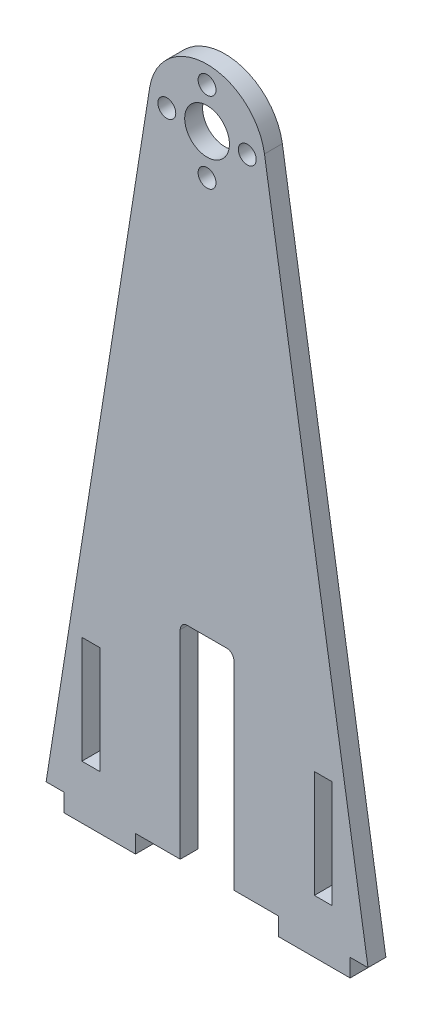
ISO-10303-21;
HEADER;
FILE_DESCRIPTION(('STEP AP214'),'2;1');
FILE_NAME('part.step','',(''),(''),'','','');
FILE_SCHEMA(('AUTOMOTIVE_DESIGN { 1 0 10303 214 1 1 1 1 }'));
ENDSEC;
DATA;
#1=APPLICATION_CONTEXT('core data for automotive mechanical design processes');
#2=APPLICATION_PROTOCOL_DEFINITION('international standard','automotive_design',2000,#1);
#3=PRODUCT_CONTEXT('',#1,'mechanical');
#4=PRODUCT('Part','Part','',(#3));
#5=PRODUCT_RELATED_PRODUCT_CATEGORY('part','',(#4));
#6=PRODUCT_DEFINITION_FORMATION('','',#4);
#7=PRODUCT_DEFINITION_CONTEXT('part definition',#1,'design');
#8=PRODUCT_DEFINITION('design','',#6,#7);
#9=PRODUCT_DEFINITION_SHAPE('','',#8);
#10=(LENGTH_UNIT() NAMED_UNIT(*) SI_UNIT(.MILLI.,.METRE.));
#11=(NAMED_UNIT(*) PLANE_ANGLE_UNIT() SI_UNIT($,.RADIAN.));
#12=(NAMED_UNIT(*) SI_UNIT($,.STERADIAN.) SOLID_ANGLE_UNIT());
#13=UNCERTAINTY_MEASURE_WITH_UNIT(LENGTH_MEASURE(1.E-05),#10,'distance_accuracy_value','');
#14=(GEOMETRIC_REPRESENTATION_CONTEXT(3) GLOBAL_UNCERTAINTY_ASSIGNED_CONTEXT((#13)) GLOBAL_UNIT_ASSIGNED_CONTEXT((#10,
#11,#12)) REPRESENTATION_CONTEXT('',''));
#15=CARTESIAN_POINT('',(0.,0.,0.));
#16=DIRECTION('',(0.,0.,1.));
#17=DIRECTION('',(1.,0.,0.));
#18=AXIS2_PLACEMENT_3D('',#15,#16,#17);
#19=CARTESIAN_POINT('',(0.,228.6,6.35));
#20=DIRECTION('',(0.,0.,1.));
#21=DIRECTION('',(1.,0.,0.));
#22=AXIS2_PLACEMENT_3D('',#19,#20,#21);
#23=PLANE('',#22);
#24=CARTESIAN_POINT('',(0.,214.3125,6.35));
#25=DIRECTION('',(0.,0.,1.));
#26=DIRECTION('',(1.,0.,0.));
#27=AXIS2_PLACEMENT_3D('',#24,#25,#26);
#28=CIRCLE('',#27,3.17499999999999);
#29=CARTESIAN_POINT('',(3.175,214.3125,6.35));
#30=VERTEX_POINT('',#29);
#31=EDGE_CURVE('E865',#30,#30,#28,.T.);
#32=ORIENTED_EDGE('',*,*,#31,.F.);
#33=EDGE_LOOP('',(#32));
#34=FACE_BOUND('',#33,.T.);
#35=CARTESIAN_POINT('',(0.,242.8875,6.35));
#36=DIRECTION('',(0.,0.,1.));
#37=DIRECTION('',(1.,0.,0.));
#38=AXIS2_PLACEMENT_3D('',#35,#36,#37);
#39=CIRCLE('',#38,3.175);
#40=CARTESIAN_POINT('',(3.175,242.8875,6.35));
#41=VERTEX_POINT('',#40);
#42=EDGE_CURVE('E246',#41,#41,#39,.T.);
#43=ORIENTED_EDGE('',*,*,#42,.F.);
#44=EDGE_LOOP('',(#43));
#45=FACE_BOUND('',#44,.T.);
#46=DIRECTION('',(1.,0.,0.));
#47=VECTOR('',#46,1.);
#48=CARTESIAN_POINT('',(-9.52499999999999,0.,6.35));
#49=LINE('',#48,#47);
#50=CARTESIAN_POINT('',(-25.4,0.,6.35));
#51=VERTEX_POINT('',#50);
#52=CARTESIAN_POINT('',(-9.52499999999999,0.,6.35));
#53=VERTEX_POINT('',#52);
#54=EDGE_CURVE('E294',#51,#53,#49,.T.);
#55=ORIENTED_EDGE('',*,*,#54,.T.);
#56=DIRECTION('',(0.,1.,0.));
#57=VECTOR('',#56,1.);
#58=CARTESIAN_POINT('',(-9.525,73.1663454116332,6.35));
#59=LINE('',#58,#57);
#60=CARTESIAN_POINT('',(-9.525,70.6263454116332,6.35));
#61=VERTEX_POINT('',#60);
#62=EDGE_CURVE('E297',#53,#61,#59,.T.);
#63=ORIENTED_EDGE('',*,*,#62,.T.);
#64=CARTESIAN_POINT('',(-6.985,70.6263454116332,6.35));
#65=DIRECTION('',(0.,0.,1.));
#66=DIRECTION('',(1.,0.,0.));
#67=AXIS2_PLACEMENT_3D('',#64,#65,#66);
#68=CIRCLE('',#67,2.54);
#69=CARTESIAN_POINT('',(-6.985,73.1663454116332,6.35));
#70=VERTEX_POINT('',#69);
#71=EDGE_CURVE('E410',#61,#70,#68,.F.);
#72=ORIENTED_EDGE('',*,*,#71,.T.);
#73=DIRECTION('',(1.,0.,0.));
#74=VECTOR('',#73,1.);
#75=CARTESIAN_POINT('',(-9.525,73.1663454116332,6.35));
#76=LINE('',#75,#74);
#77=CARTESIAN_POINT('',(6.98499999999999,73.1663454116332,6.35));
#78=VERTEX_POINT('',#77);
#79=EDGE_CURVE('E301',#70,#78,#76,.T.);
#80=ORIENTED_EDGE('',*,*,#79,.T.);
#81=CARTESIAN_POINT('',(6.985,70.6263454116332,6.35));
#82=DIRECTION('',(0.,0.,1.));
#83=DIRECTION('',(1.,0.,0.));
#84=AXIS2_PLACEMENT_3D('',#81,#82,#83);
#85=CIRCLE('',#84,2.54);
#86=CARTESIAN_POINT('',(9.525,70.6263454116332,6.35));
#87=VERTEX_POINT('',#86);
#88=EDGE_CURVE('E11',#78,#87,#85,.F.);
#89=ORIENTED_EDGE('',*,*,#88,.T.);
#90=DIRECTION('',(0.,-1.,0.));
#91=VECTOR('',#90,1.);
#92=CARTESIAN_POINT('',(9.525,73.1663454116332,6.35));
#93=LINE('',#92,#91);
#94=CARTESIAN_POINT('',(9.52499999999999,0.,6.35));
#95=VERTEX_POINT('',#94);
#96=EDGE_CURVE('E303',#87,#95,#93,.T.);
#97=ORIENTED_EDGE('',*,*,#96,.T.);
#98=DIRECTION('',(1.,0.,0.));
#99=VECTOR('',#98,1.);
#100=CARTESIAN_POINT('',(25.4,0.,6.35));
#101=LINE('',#100,#99);
#102=CARTESIAN_POINT('',(25.4,0.,6.35));
#103=VERTEX_POINT('',#102);
#104=EDGE_CURVE('E305',#95,#103,#101,.T.);
#105=ORIENTED_EDGE('',*,*,#104,.T.);
#106=DIRECTION('',(0.,-1.,0.));
#107=VECTOR('',#106,1.);
#108=CARTESIAN_POINT('',(25.4,0.,6.35));
#109=LINE('',#108,#107);
#110=CARTESIAN_POINT('',(25.4,-6.35,6.35));
#111=VERTEX_POINT('',#110);
#112=EDGE_CURVE('E307',#103,#111,#109,.T.);
#113=ORIENTED_EDGE('',*,*,#112,.T.);
#114=DIRECTION('',(1.,0.,0.));
#115=VECTOR('',#114,1.);
#116=CARTESIAN_POINT('',(25.4,-6.35,6.35));
#117=LINE('',#116,#115);
#118=CARTESIAN_POINT('',(50.8,-6.35000000000001,6.35));
#119=VERTEX_POINT('',#118);
#120=EDGE_CURVE('E309',#111,#119,#117,.T.);
#121=ORIENTED_EDGE('',*,*,#120,.T.);
#122=DIRECTION('',(0.,1.,0.));
#123=VECTOR('',#122,1.);
#124=CARTESIAN_POINT('',(50.8,-6.35000000000001,6.35));
#125=LINE('',#124,#123);
#126=CARTESIAN_POINT('',(50.8,0.,6.35));
#127=VERTEX_POINT('',#126);
#128=EDGE_CURVE('E311',#119,#127,#125,.T.);
#129=ORIENTED_EDGE('',*,*,#128,.T.);
#130=DIRECTION('',(1.,0.,0.));
#131=VECTOR('',#130,1.);
#132=CARTESIAN_POINT('',(50.8,0.,6.35));
#133=LINE('',#132,#131);
#134=CARTESIAN_POINT('',(57.15,0.,6.35));
#135=VERTEX_POINT('',#134);
#136=EDGE_CURVE('E313',#127,#135,#133,.T.);
#137=ORIENTED_EDGE('',*,*,#136,.T.);
#138=DIRECTION('',(-0.156636309817332,0.987656350380439,0.));
#139=VECTOR('',#138,1.);
#140=CARTESIAN_POINT('',(57.15,0.,6.35));
#141=LINE('',#140,#139);
#142=CARTESIAN_POINT('',(20.3827579309763,231.832581843855,6.35));
#143=VERTEX_POINT('',#142);
#144=EDGE_CURVE('E315',#135,#143,#141,.T.);
#145=ORIENTED_EDGE('',*,*,#144,.T.);
#146=CARTESIAN_POINT('',(0.,228.6,6.35));
#147=DIRECTION('',(0.,0.,1.));
#148=DIRECTION('',(1.,0.,0.));
#149=AXIS2_PLACEMENT_3D('',#146,#147,#148);
#150=CIRCLE('',#149,20.6375);
#151=CARTESIAN_POINT('',(-20.3827579309763,231.832581843855,6.35));
#152=VERTEX_POINT('',#151);
#153=EDGE_CURVE('E317',#143,#152,#150,.T.);
#154=ORIENTED_EDGE('',*,*,#153,.T.);
#155=DIRECTION('',(-0.156636309817332,-0.987656350380439,0.));
#156=VECTOR('',#155,1.);
#157=CARTESIAN_POINT('',(-57.15,0.,6.35));
#158=LINE('',#157,#156);
#159=CARTESIAN_POINT('',(-57.15,0.,6.35));
#160=VERTEX_POINT('',#159);
#161=EDGE_CURVE('E319',#152,#160,#158,.T.);
#162=ORIENTED_EDGE('',*,*,#161,.T.);
#163=DIRECTION('',(1.,0.,0.));
#164=VECTOR('',#163,1.);
#165=CARTESIAN_POINT('',(-50.8,0.,6.35));
#166=LINE('',#165,#164);
#167=CARTESIAN_POINT('',(-50.8,0.,6.35));
#168=VERTEX_POINT('',#167);
#169=EDGE_CURVE('E321',#160,#168,#166,.T.);
#170=ORIENTED_EDGE('',*,*,#169,.T.);
#171=DIRECTION('',(0.,-1.,0.));
#172=VECTOR('',#171,1.);
#173=CARTESIAN_POINT('',(-50.8,-6.35000000000001,6.35));
#174=LINE('',#173,#172);
#175=CARTESIAN_POINT('',(-50.8,-6.35000000000001,6.35));
#176=VERTEX_POINT('',#175);
#177=EDGE_CURVE('E323',#168,#176,#174,.T.);
#178=ORIENTED_EDGE('',*,*,#177,.T.);
#179=DIRECTION('',(1.,0.,0.));
#180=VECTOR('',#179,1.);
#181=CARTESIAN_POINT('',(-25.4,-6.35,6.35));
#182=LINE('',#181,#180);
#183=CARTESIAN_POINT('',(-25.4,-6.35,6.35));
#184=VERTEX_POINT('',#183);
#185=EDGE_CURVE('E325',#176,#184,#182,.T.);
#186=ORIENTED_EDGE('',*,*,#185,.T.);
#187=DIRECTION('',(0.,1.,0.));
#188=VECTOR('',#187,1.);
#189=CARTESIAN_POINT('',(-25.4,0.,6.35));
#190=LINE('',#189,#188);
#191=EDGE_CURVE('E327',#184,#51,#190,.T.);
#192=ORIENTED_EDGE('',*,*,#191,.T.);
#193=EDGE_LOOP('',(#55,#63,#72,#80,#89,#97,#105,#113,#121,#129,#137,#145,#154,#162,#170,#178,
#186,#192));
#194=FACE_BOUND('',#193,.T.);
#195=CARTESIAN_POINT('',(0.,228.6,6.35));
#196=DIRECTION('',(0.,0.,1.));
#197=DIRECTION('',(1.,0.,0.));
#198=AXIS2_PLACEMENT_3D('',#195,#196,#197);
#199=CIRCLE('',#198,7.9375);
#200=CARTESIAN_POINT('',(7.93749999999999,228.6,6.35));
#201=VERTEX_POINT('',#200);
#202=EDGE_CURVE('E288',#201,#201,#199,.T.);
#203=ORIENTED_EDGE('',*,*,#202,.F.);
#204=EDGE_LOOP('',(#203));
#205=FACE_BOUND('',#204,.T.);
#206=DIRECTION('',(1.,0.,0.));
#207=VECTOR('',#206,1.);
#208=CARTESIAN_POINT('',(-44.4500000000008,12.7,6.35));
#209=LINE('',#208,#207);
#210=CARTESIAN_POINT('',(-44.4500000000008,12.7,6.35));
#211=VERTEX_POINT('',#210);
#212=CARTESIAN_POINT('',(-38.1000000000004,12.7,6.35));
#213=VERTEX_POINT('',#212);
#214=EDGE_CURVE('E259',#211,#213,#209,.T.);
#215=ORIENTED_EDGE('',*,*,#214,.F.);
#216=DIRECTION('',(0.,-1.,0.));
#217=VECTOR('',#216,1.);
#218=CARTESIAN_POINT('',(-44.4500000000008,12.7,6.35));
#219=LINE('',#218,#217);
#220=CARTESIAN_POINT('',(-44.4500000000008,50.8,6.35));
#221=VERTEX_POINT('',#220);
#222=EDGE_CURVE('E257',#221,#211,#219,.T.);
#223=ORIENTED_EDGE('',*,*,#222,.F.);
#224=DIRECTION('',(-1.,0.,0.));
#225=VECTOR('',#224,1.);
#226=CARTESIAN_POINT('',(-44.4500000000008,50.8,6.35));
#227=LINE('',#226,#225);
#228=CARTESIAN_POINT('',(-38.1000000000004,50.8,6.35));
#229=VERTEX_POINT('',#228);
#230=EDGE_CURVE('E265',#229,#221,#227,.T.);
#231=ORIENTED_EDGE('',*,*,#230,.F.);
#232=DIRECTION('',(0.,1.,0.));
#233=VECTOR('',#232,1.);
#234=CARTESIAN_POINT('',(-38.1000000000004,12.7,6.35));
#235=LINE('',#234,#233);
#236=EDGE_CURVE('E262',#213,#229,#235,.T.);
#237=ORIENTED_EDGE('',*,*,#236,.F.);
#238=EDGE_LOOP('',(#215,#223,#231,#237));
#239=FACE_BOUND('',#238,.T.);
#240=DIRECTION('',(-1.,0.,0.));
#241=VECTOR('',#240,1.);
#242=CARTESIAN_POINT('',(44.4500000000008,50.8,6.35));
#243=LINE('',#242,#241);
#244=CARTESIAN_POINT('',(44.4500000000008,50.8,6.35));
#245=VERTEX_POINT('',#244);
#246=CARTESIAN_POINT('',(38.1000000000004,50.8,6.35));
#247=VERTEX_POINT('',#246);
#248=EDGE_CURVE('E223',#245,#247,#243,.T.);
#249=ORIENTED_EDGE('',*,*,#248,.F.);
#250=DIRECTION('',(0.,1.,0.));
#251=VECTOR('',#250,1.);
#252=CARTESIAN_POINT('',(44.4500000000008,12.7,6.35));
#253=LINE('',#252,#251);
#254=CARTESIAN_POINT('',(44.4500000000008,12.7,6.35));
#255=VERTEX_POINT('',#254);
#256=EDGE_CURVE('E213',#255,#245,#253,.T.);
#257=ORIENTED_EDGE('',*,*,#256,.F.);
#258=DIRECTION('',(1.,0.,0.));
#259=VECTOR('',#258,1.);
#260=CARTESIAN_POINT('',(44.4500000000008,12.7,6.35));
#261=LINE('',#260,#259);
#262=CARTESIAN_POINT('',(38.1000000000004,12.7,6.35));
#263=VERTEX_POINT('',#262);
#264=EDGE_CURVE('E239',#263,#255,#261,.T.);
#265=ORIENTED_EDGE('',*,*,#264,.F.);
#266=DIRECTION('',(0.,-1.,0.));
#267=VECTOR('',#266,1.);
#268=CARTESIAN_POINT('',(38.1000000000004,12.7,6.35));
#269=LINE('',#268,#267);
#270=EDGE_CURVE('E237',#247,#263,#269,.T.);
#271=ORIENTED_EDGE('',*,*,#270,.F.);
#272=EDGE_LOOP('',(#249,#257,#265,#271));
#273=FACE_BOUND('',#272,.T.);
#274=CARTESIAN_POINT('',(14.2875,228.6,6.35));
#275=DIRECTION('',(0.,0.,1.));
#276=DIRECTION('',(1.,0.,0.));
#277=AXIS2_PLACEMENT_3D('',#274,#275,#276);
#278=CIRCLE('',#277,3.175);
#279=CARTESIAN_POINT('',(17.4625,228.6,6.35));
#280=VERTEX_POINT('',#279);
#281=EDGE_CURVE('E871',#280,#280,#278,.T.);
#282=ORIENTED_EDGE('',*,*,#281,.F.);
#283=EDGE_LOOP('',(#282));
#284=FACE_BOUND('',#283,.T.);
#285=CARTESIAN_POINT('',(-14.2875,228.6,6.35));
#286=DIRECTION('',(0.,0.,1.));
#287=DIRECTION('',(1.,0.,0.));
#288=AXIS2_PLACEMENT_3D('',#285,#286,#287);
#289=CIRCLE('',#288,3.17500000000001);
#290=CARTESIAN_POINT('',(-11.1125,228.6,6.35));
#291=VERTEX_POINT('',#290);
#292=EDGE_CURVE('E856',#291,#291,#289,.T.);
#293=ORIENTED_EDGE('',*,*,#292,.F.);
#294=EDGE_LOOP('',(#293));
#295=FACE_BOUND('',#294,.T.);
#296=ADVANCED_FACE('F39',(#34,#45,#194,#205,#239,#273,#284,#295),#23,.T.);
#297=CARTESIAN_POINT('',(0.,228.6,0.));
#298=DIRECTION('',(0.,0.,1.));
#299=DIRECTION('',(1.,0.,0.));
#300=AXIS2_PLACEMENT_3D('',#297,#298,#299);
#301=PLANE('',#300);
#302=DIRECTION('',(0.,-1.,0.));
#303=VECTOR('',#302,1.);
#304=CARTESIAN_POINT('',(-44.4500000000008,12.7,0.));
#305=LINE('',#304,#303);
#306=CARTESIAN_POINT('',(-44.4500000000008,50.8,0.));
#307=VERTEX_POINT('',#306);
#308=CARTESIAN_POINT('',(-44.4500000000008,12.7,0.));
#309=VERTEX_POINT('',#308);
#310=EDGE_CURVE('E231',#307,#309,#305,.T.);
#311=ORIENTED_EDGE('',*,*,#310,.T.);
#312=DIRECTION('',(1.,0.,0.));
#313=VECTOR('',#312,1.);
#314=CARTESIAN_POINT('',(-44.4500000000008,12.7,0.));
#315=LINE('',#314,#313);
#316=CARTESIAN_POINT('',(-38.1000000000004,12.7,0.));
#317=VERTEX_POINT('',#316);
#318=EDGE_CURVE('E270',#309,#317,#315,.T.);
#319=ORIENTED_EDGE('',*,*,#318,.T.);
#320=DIRECTION('',(0.,1.,0.));
#321=VECTOR('',#320,1.);
#322=CARTESIAN_POINT('',(-38.1000000000004,12.7,0.));
#323=LINE('',#322,#321);
#324=CARTESIAN_POINT('',(-38.1000000000004,50.8,0.));
#325=VERTEX_POINT('',#324);
#326=EDGE_CURVE('E273',#317,#325,#323,.T.);
#327=ORIENTED_EDGE('',*,*,#326,.T.);
#328=DIRECTION('',(-1.,0.,0.));
#329=VECTOR('',#328,1.);
#330=CARTESIAN_POINT('',(-44.4500000000008,50.8,0.));
#331=LINE('',#330,#329);
#332=EDGE_CURVE('E260',#325,#307,#331,.T.);
#333=ORIENTED_EDGE('',*,*,#332,.T.);
#334=EDGE_LOOP('',(#311,#319,#327,#333));
#335=FACE_BOUND('',#334,.T.);
#336=DIRECTION('',(1.,0.,0.));
#337=VECTOR('',#336,1.);
#338=CARTESIAN_POINT('',(-9.52499999999999,0.,0.));
#339=LINE('',#338,#337);
#340=CARTESIAN_POINT('',(-25.4,0.,0.));
#341=VERTEX_POINT('',#340);
#342=CARTESIAN_POINT('',(-9.52499999999999,0.,0.));
#343=VERTEX_POINT('',#342);
#344=EDGE_CURVE('E291',#341,#343,#339,.T.);
#345=ORIENTED_EDGE('',*,*,#344,.F.);
#346=DIRECTION('',(0.,1.,0.));
#347=VECTOR('',#346,1.);
#348=CARTESIAN_POINT('',(-25.4,0.,0.));
#349=LINE('',#348,#347);
#350=CARTESIAN_POINT('',(-25.4,-6.35,0.));
#351=VERTEX_POINT('',#350);
#352=EDGE_CURVE('E298',#351,#341,#349,.T.);
#353=ORIENTED_EDGE('',*,*,#352,.F.);
#354=DIRECTION('',(1.,0.,0.));
#355=VECTOR('',#354,1.);
#356=CARTESIAN_POINT('',(-25.4,-6.35,0.));
#357=LINE('',#356,#355);
#358=CARTESIAN_POINT('',(-50.8,-6.35000000000001,0.));
#359=VERTEX_POINT('',#358);
#360=EDGE_CURVE('E359',#359,#351,#357,.T.);
#361=ORIENTED_EDGE('',*,*,#360,.F.);
#362=DIRECTION('',(0.,-1.,0.));
#363=VECTOR('',#362,1.);
#364=CARTESIAN_POINT('',(-50.8,-6.35000000000001,0.));
#365=LINE('',#364,#363);
#366=CARTESIAN_POINT('',(-50.8,0.,0.));
#367=VERTEX_POINT('',#366);
#368=EDGE_CURVE('E357',#367,#359,#365,.T.);
#369=ORIENTED_EDGE('',*,*,#368,.F.);
#370=DIRECTION('',(1.,0.,0.));
#371=VECTOR('',#370,1.);
#372=CARTESIAN_POINT('',(-50.8,0.,0.));
#373=LINE('',#372,#371);
#374=CARTESIAN_POINT('',(-57.15,0.,0.));
#375=VERTEX_POINT('',#374);
#376=EDGE_CURVE('E355',#375,#367,#373,.T.);
#377=ORIENTED_EDGE('',*,*,#376,.F.);
#378=DIRECTION('',(-0.156636309817332,-0.987656350380439,0.));
#379=VECTOR('',#378,1.);
#380=CARTESIAN_POINT('',(-57.15,0.,0.));
#381=LINE('',#380,#379);
#382=CARTESIAN_POINT('',(-20.3827579309763,231.832581843855,0.));
#383=VERTEX_POINT('',#382);
#384=EDGE_CURVE('E353',#383,#375,#381,.T.);
#385=ORIENTED_EDGE('',*,*,#384,.F.);
#386=CARTESIAN_POINT('',(0.,228.6,0.));
#387=DIRECTION('',(0.,0.,1.));
#388=DIRECTION('',(1.,0.,0.));
#389=AXIS2_PLACEMENT_3D('',#386,#387,#388);
#390=CIRCLE('',#389,20.6375);
#391=CARTESIAN_POINT('',(20.3827579309763,231.832581843855,0.));
#392=VERTEX_POINT('',#391);
#393=EDGE_CURVE('E351',#392,#383,#390,.T.);
#394=ORIENTED_EDGE('',*,*,#393,.F.);
#395=DIRECTION('',(-0.156636309817332,0.987656350380439,0.));
#396=VECTOR('',#395,1.);
#397=CARTESIAN_POINT('',(57.15,0.,0.));
#398=LINE('',#397,#396);
#399=CARTESIAN_POINT('',(57.15,0.,0.));
#400=VERTEX_POINT('',#399);
#401=EDGE_CURVE('E349',#400,#392,#398,.T.);
#402=ORIENTED_EDGE('',*,*,#401,.F.);
#403=DIRECTION('',(1.,0.,0.));
#404=VECTOR('',#403,1.);
#405=CARTESIAN_POINT('',(50.8,0.,0.));
#406=LINE('',#405,#404);
#407=CARTESIAN_POINT('',(50.8,0.,0.));
#408=VERTEX_POINT('',#407);
#409=EDGE_CURVE('E347',#408,#400,#406,.T.);
#410=ORIENTED_EDGE('',*,*,#409,.F.);
#411=DIRECTION('',(0.,1.,0.));
#412=VECTOR('',#411,1.);
#413=CARTESIAN_POINT('',(50.8,-6.35000000000001,0.));
#414=LINE('',#413,#412);
#415=CARTESIAN_POINT('',(50.8,-6.35000000000001,0.));
#416=VERTEX_POINT('',#415);
#417=EDGE_CURVE('E345',#416,#408,#414,.T.);
#418=ORIENTED_EDGE('',*,*,#417,.F.);
#419=DIRECTION('',(1.,0.,0.));
#420=VECTOR('',#419,1.);
#421=CARTESIAN_POINT('',(25.4,-6.35,0.));
#422=LINE('',#421,#420);
#423=CARTESIAN_POINT('',(25.4,-6.35,0.));
#424=VERTEX_POINT('',#423);
#425=EDGE_CURVE('E343',#424,#416,#422,.T.);
#426=ORIENTED_EDGE('',*,*,#425,.F.);
#427=DIRECTION('',(0.,-1.,0.));
#428=VECTOR('',#427,1.);
#429=CARTESIAN_POINT('',(25.4,0.,0.));
#430=LINE('',#429,#428);
#431=CARTESIAN_POINT('',(25.4,0.,0.));
#432=VERTEX_POINT('',#431);
#433=EDGE_CURVE('E341',#432,#424,#430,.T.);
#434=ORIENTED_EDGE('',*,*,#433,.F.);
#435=DIRECTION('',(1.,0.,0.));
#436=VECTOR('',#435,1.);
#437=CARTESIAN_POINT('',(25.4,0.,0.));
#438=LINE('',#437,#436);
#439=CARTESIAN_POINT('',(9.52499999999999,0.,0.));
#440=VERTEX_POINT('',#439);
#441=EDGE_CURVE('E339',#440,#432,#438,.T.);
#442=ORIENTED_EDGE('',*,*,#441,.F.);
#443=DIRECTION('',(0.,-1.,0.));
#444=VECTOR('',#443,1.);
#445=CARTESIAN_POINT('',(9.525,73.1663454116332,0.));
#446=LINE('',#445,#444);
#447=CARTESIAN_POINT('',(9.525,70.6263454116332,0.));
#448=VERTEX_POINT('',#447);
#449=EDGE_CURVE('E337',#448,#440,#446,.T.);
#450=ORIENTED_EDGE('',*,*,#449,.F.);
#451=CARTESIAN_POINT('',(6.985,70.6263454116332,0.));
#452=DIRECTION('',(0.,0.,1.));
#453=DIRECTION('',(1.,0.,0.));
#454=AXIS2_PLACEMENT_3D('',#451,#452,#453);
#455=CIRCLE('',#454,2.54);
#456=CARTESIAN_POINT('',(6.98499999999999,73.1663454116332,0.));
#457=VERTEX_POINT('',#456);
#458=EDGE_CURVE('E47',#448,#457,#455,.T.);
#459=ORIENTED_EDGE('',*,*,#458,.T.);
#460=DIRECTION('',(1.,0.,0.));
#461=VECTOR('',#460,1.);
#462=CARTESIAN_POINT('',(-9.525,73.1663454116332,0.));
#463=LINE('',#462,#461);
#464=CARTESIAN_POINT('',(-6.985,73.1663454116332,0.));
#465=VERTEX_POINT('',#464);
#466=EDGE_CURVE('E335',#465,#457,#463,.T.);
#467=ORIENTED_EDGE('',*,*,#466,.F.);
#468=CARTESIAN_POINT('',(-6.985,70.6263454116332,0.));
#469=DIRECTION('',(0.,0.,1.));
#470=DIRECTION('',(1.,0.,0.));
#471=AXIS2_PLACEMENT_3D('',#468,#469,#470);
#472=CIRCLE('',#471,2.54);
#473=CARTESIAN_POINT('',(-9.525,70.6263454116332,0.));
#474=VERTEX_POINT('',#473);
#475=EDGE_CURVE('E408',#465,#474,#472,.T.);
#476=ORIENTED_EDGE('',*,*,#475,.T.);
#477=DIRECTION('',(0.,1.,0.));
#478=VECTOR('',#477,1.);
#479=CARTESIAN_POINT('',(-9.525,73.1663454116332,0.));
#480=LINE('',#479,#478);
#481=EDGE_CURVE('E332',#343,#474,#480,.T.);
#482=ORIENTED_EDGE('',*,*,#481,.F.);
#483=EDGE_LOOP('',(#345,#353,#361,#369,#377,#385,#394,#402,#410,#418,#426,#434,#442,#450,#459,
#467,#476,#482));
#484=FACE_BOUND('',#483,.T.);
#485=CARTESIAN_POINT('',(0.,228.6,0.));
#486=DIRECTION('',(0.,0.,1.));
#487=DIRECTION('',(1.,0.,0.));
#488=AXIS2_PLACEMENT_3D('',#485,#486,#487);
#489=CIRCLE('',#488,7.9375);
#490=CARTESIAN_POINT('',(7.93749999999999,228.6,0.));
#491=VERTEX_POINT('',#490);
#492=EDGE_CURVE('E287',#491,#491,#489,.T.);
#493=ORIENTED_EDGE('',*,*,#492,.T.);
#494=EDGE_LOOP('',(#493));
#495=FACE_BOUND('',#494,.T.);
#496=DIRECTION('',(0.,1.,0.));
#497=VECTOR('',#496,1.);
#498=CARTESIAN_POINT('',(44.4500000000008,12.7,0.));
#499=LINE('',#498,#497);
#500=CARTESIAN_POINT('',(44.4500000000008,12.7,0.));
#501=VERTEX_POINT('',#500);
#502=CARTESIAN_POINT('',(44.4500000000008,50.8,0.));
#503=VERTEX_POINT('',#502);
#504=EDGE_CURVE('E244',#501,#503,#499,.T.);
#505=ORIENTED_EDGE('',*,*,#504,.T.);
#506=DIRECTION('',(-1.,0.,0.));
#507=VECTOR('',#506,1.);
#508=CARTESIAN_POINT('',(44.4500000000008,50.8,0.));
#509=LINE('',#508,#507);
#510=CARTESIAN_POINT('',(38.1000000000004,50.8,0.));
#511=VERTEX_POINT('',#510);
#512=EDGE_CURVE('E230',#503,#511,#509,.T.);
#513=ORIENTED_EDGE('',*,*,#512,.T.);
#514=DIRECTION('',(0.,-1.,0.));
#515=VECTOR('',#514,1.);
#516=CARTESIAN_POINT('',(38.1000000000004,12.7,0.));
#517=LINE('',#516,#515);
#518=CARTESIAN_POINT('',(38.1000000000004,12.7,0.));
#519=VERTEX_POINT('',#518);
#520=EDGE_CURVE('E248',#511,#519,#517,.T.);
#521=ORIENTED_EDGE('',*,*,#520,.T.);
#522=DIRECTION('',(1.,0.,0.));
#523=VECTOR('',#522,1.);
#524=CARTESIAN_POINT('',(44.4500000000008,12.7,0.));
#525=LINE('',#524,#523);
#526=EDGE_CURVE('E224',#519,#501,#525,.T.);
#527=ORIENTED_EDGE('',*,*,#526,.T.);
#528=EDGE_LOOP('',(#505,#513,#521,#527));
#529=FACE_BOUND('',#528,.T.);
#530=CARTESIAN_POINT('',(0.,242.8875,0.));
#531=DIRECTION('',(0.,0.,1.));
#532=DIRECTION('',(1.,0.,0.));
#533=AXIS2_PLACEMENT_3D('',#530,#531,#532);
#534=CIRCLE('',#533,3.175);
#535=CARTESIAN_POINT('',(3.175,242.8875,0.));
#536=VERTEX_POINT('',#535);
#537=EDGE_CURVE('E874',#536,#536,#534,.T.);
#538=ORIENTED_EDGE('',*,*,#537,.T.);
#539=EDGE_LOOP('',(#538));
#540=FACE_BOUND('',#539,.T.);
#541=CARTESIAN_POINT('',(14.2875,228.6,0.));
#542=DIRECTION('',(0.,0.,1.));
#543=DIRECTION('',(1.,0.,0.));
#544=AXIS2_PLACEMENT_3D('',#541,#542,#543);
#545=CIRCLE('',#544,3.175);
#546=CARTESIAN_POINT('',(17.4625,228.6,0.));
#547=VERTEX_POINT('',#546);
#548=EDGE_CURVE('E868',#547,#547,#545,.T.);
#549=ORIENTED_EDGE('',*,*,#548,.T.);
#550=EDGE_LOOP('',(#549));
#551=FACE_BOUND('',#550,.T.);
#552=CARTESIAN_POINT('',(0.,214.3125,0.));
#553=DIRECTION('',(0.,0.,1.));
#554=DIRECTION('',(1.,0.,0.));
#555=AXIS2_PLACEMENT_3D('',#552,#553,#554);
#556=CIRCLE('',#555,3.17499999999999);
#557=CARTESIAN_POINT('',(3.175,214.3125,0.));
#558=VERTEX_POINT('',#557);
#559=EDGE_CURVE('E862',#558,#558,#556,.T.);
#560=ORIENTED_EDGE('',*,*,#559,.T.);
#561=EDGE_LOOP('',(#560));
#562=FACE_BOUND('',#561,.T.);
#563=CARTESIAN_POINT('',(-14.2875,228.6,0.));
#564=DIRECTION('',(0.,0.,1.));
#565=DIRECTION('',(1.,0.,0.));
#566=AXIS2_PLACEMENT_3D('',#563,#564,#565);
#567=CIRCLE('',#566,3.17500000000001);
#568=CARTESIAN_POINT('',(-11.1125,228.6,0.));
#569=VERTEX_POINT('',#568);
#570=EDGE_CURVE('E859',#569,#569,#567,.T.);
#571=ORIENTED_EDGE('',*,*,#570,.T.);
#572=EDGE_LOOP('',(#571));
#573=FACE_BOUND('',#572,.T.);
#574=ADVANCED_FACE('F424',(#335,#484,#495,#529,#540,#551,#562,#573),#301,.F.);
#575=CARTESIAN_POINT('',(-9.52499999999999,0.,6.35));
#576=DIRECTION('',(0.,1.,0.));
#577=DIRECTION('',(-1.,0.,0.));
#578=AXIS2_PLACEMENT_3D('',#575,#576,#577);
#579=PLANE('',#578);
#580=ORIENTED_EDGE('',*,*,#344,.T.);
#581=DIRECTION('',(0.,0.,-1.));
#582=VECTOR('',#581,1.);
#583=CARTESIAN_POINT('',(-9.52499999999999,0.,6.35));
#584=LINE('',#583,#582);
#585=EDGE_CURVE('E400',#53,#343,#584,.T.);
#586=ORIENTED_EDGE('',*,*,#585,.F.);
#587=ORIENTED_EDGE('',*,*,#54,.F.);
#588=DIRECTION('',(0.,0.,-1.));
#589=VECTOR('',#588,1.);
#590=CARTESIAN_POINT('',(-25.4,0.,6.35));
#591=LINE('',#590,#589);
#592=EDGE_CURVE('E329',#51,#341,#591,.T.);
#593=ORIENTED_EDGE('',*,*,#592,.T.);
#594=EDGE_LOOP('',(#580,#586,#587,#593));
#595=FACE_BOUND('',#594,.T.);
#596=ADVANCED_FACE('F453',(#595),#579,.F.);
#597=CARTESIAN_POINT('',(-9.525,73.1663454116332,6.35));
#598=DIRECTION('',(-1.,0.,0.));
#599=DIRECTION('',(0.,-1.,0.));
#600=AXIS2_PLACEMENT_3D('',#597,#598,#599);
#601=PLANE('',#600);
#602=ORIENTED_EDGE('',*,*,#481,.T.);
#603=DIRECTION('',(0.,0.,-1.));
#604=VECTOR('',#603,1.);
#605=CARTESIAN_POINT('',(-9.525,70.6263454116332,6.35));
#606=LINE('',#605,#604);
#607=EDGE_CURVE('E406',#474,#61,#606,.F.);
#608=ORIENTED_EDGE('',*,*,#607,.T.);
#609=ORIENTED_EDGE('',*,*,#62,.F.);
#610=ORIENTED_EDGE('',*,*,#585,.T.);
#611=EDGE_LOOP('',(#602,#608,#609,#610));
#612=FACE_BOUND('',#611,.T.);
#613=ADVANCED_FACE('F511',(#612),#601,.F.);
#614=CARTESIAN_POINT('',(-9.525,73.1663454116332,6.35));
#615=DIRECTION('',(0.,1.,0.));
#616=DIRECTION('',(0.,0.,1.));
#617=AXIS2_PLACEMENT_3D('',#614,#615,#616);
#618=PLANE('',#617);
#619=ORIENTED_EDGE('',*,*,#466,.T.);
#620=DIRECTION('',(0.,0.,-1.));
#621=VECTOR('',#620,1.);
#622=CARTESIAN_POINT('',(6.985,73.1663454116332,6.35));
#623=LINE('',#622,#621);
#624=EDGE_CURVE('E60',#457,#78,#623,.F.);
#625=ORIENTED_EDGE('',*,*,#624,.T.);
#626=ORIENTED_EDGE('',*,*,#79,.F.);
#627=DIRECTION('',(0.,0.,-1.));
#628=VECTOR('',#627,1.);
#629=CARTESIAN_POINT('',(-6.985,73.1663454116332,0.));
#630=LINE('',#629,#628);
#631=EDGE_CURVE('E403',#70,#465,#630,.T.);
#632=ORIENTED_EDGE('',*,*,#631,.T.);
#633=EDGE_LOOP('',(#619,#625,#626,#632));
#634=FACE_BOUND('',#633,.T.);
#635=ADVANCED_FACE('F508',(#634),#618,.F.);
#636=CARTESIAN_POINT('',(9.525,73.1663454116332,6.35));
#637=DIRECTION('',(1.,0.,0.));
#638=DIRECTION('',(0.,1.,0.));
#639=AXIS2_PLACEMENT_3D('',#636,#637,#638);
#640=PLANE('',#639);
#641=ORIENTED_EDGE('',*,*,#96,.F.);
#642=DIRECTION('',(0.,0.,-1.));
#643=VECTOR('',#642,1.);
#644=CARTESIAN_POINT('',(9.525,70.6263454116332,0.));
#645=LINE('',#644,#643);
#646=EDGE_CURVE('E412',#87,#448,#645,.T.);
#647=ORIENTED_EDGE('',*,*,#646,.T.);
#648=ORIENTED_EDGE('',*,*,#449,.T.);
#649=DIRECTION('',(0.,0.,-1.));
#650=VECTOR('',#649,1.);
#651=CARTESIAN_POINT('',(9.52499999999999,0.,6.35));
#652=LINE('',#651,#650);
#653=EDGE_CURVE('E397',#95,#440,#652,.T.);
#654=ORIENTED_EDGE('',*,*,#653,.F.);
#655=EDGE_LOOP('',(#641,#647,#648,#654));
#656=FACE_BOUND('',#655,.T.);
#657=ADVANCED_FACE('F418',(#656),#640,.F.);
#658=CARTESIAN_POINT('',(25.4,0.,6.35));
#659=DIRECTION('',(0.,1.,0.));
#660=DIRECTION('',(-1.,0.,0.));
#661=AXIS2_PLACEMENT_3D('',#658,#659,#660);
#662=PLANE('',#661);
#663=ORIENTED_EDGE('',*,*,#441,.T.);
#664=DIRECTION('',(0.,0.,-1.));
#665=VECTOR('',#664,1.);
#666=CARTESIAN_POINT('',(25.4,0.,6.35));
#667=LINE('',#666,#665);
#668=EDGE_CURVE('E394',#103,#432,#667,.T.);
#669=ORIENTED_EDGE('',*,*,#668,.F.);
#670=ORIENTED_EDGE('',*,*,#104,.F.);
#671=ORIENTED_EDGE('',*,*,#653,.T.);
#672=EDGE_LOOP('',(#663,#669,#670,#671));
#673=FACE_BOUND('',#672,.T.);
#674=ADVANCED_FACE('F430',(#673),#662,.F.);
#675=CARTESIAN_POINT('',(25.4,0.,6.35));
#676=DIRECTION('',(1.,0.,0.));
#677=DIRECTION('',(0.,0.,-1.));
#678=AXIS2_PLACEMENT_3D('',#675,#676,#677);
#679=PLANE('',#678);
#680=ORIENTED_EDGE('',*,*,#433,.T.);
#681=DIRECTION('',(0.,0.,-1.));
#682=VECTOR('',#681,1.);
#683=CARTESIAN_POINT('',(25.4,-6.35,6.35));
#684=LINE('',#683,#682);
#685=EDGE_CURVE('E391',#111,#424,#684,.T.);
#686=ORIENTED_EDGE('',*,*,#685,.F.);
#687=ORIENTED_EDGE('',*,*,#112,.F.);
#688=ORIENTED_EDGE('',*,*,#668,.T.);
#689=EDGE_LOOP('',(#680,#686,#687,#688));
#690=FACE_BOUND('',#689,.T.);
#691=ADVANCED_FACE('F434',(#690),#679,.F.);
#692=CARTESIAN_POINT('',(25.4,-6.35,6.35));
#693=DIRECTION('',(0.,1.,0.));
#694=DIRECTION('',(-1.,0.,0.));
#695=AXIS2_PLACEMENT_3D('',#692,#693,#694);
#696=PLANE('',#695);
#697=ORIENTED_EDGE('',*,*,#425,.T.);
#698=DIRECTION('',(0.,0.,-1.));
#699=VECTOR('',#698,1.);
#700=CARTESIAN_POINT('',(50.8,-6.35000000000001,6.35));
#701=LINE('',#700,#699);
#702=EDGE_CURVE('E388',#119,#416,#701,.T.);
#703=ORIENTED_EDGE('',*,*,#702,.F.);
#704=ORIENTED_EDGE('',*,*,#120,.F.);
#705=ORIENTED_EDGE('',*,*,#685,.T.);
#706=EDGE_LOOP('',(#697,#703,#704,#705));
#707=FACE_BOUND('',#706,.T.);
#708=ADVANCED_FACE('F497',(#707),#696,.F.);
#709=CARTESIAN_POINT('',(50.8,-6.35000000000001,6.35));
#710=DIRECTION('',(-1.,0.,0.));
#711=DIRECTION('',(0.,0.,1.));
#712=AXIS2_PLACEMENT_3D('',#709,#710,#711);
#713=PLANE('',#712);
#714=ORIENTED_EDGE('',*,*,#417,.T.);
#715=DIRECTION('',(0.,0.,-1.));
#716=VECTOR('',#715,1.);
#717=CARTESIAN_POINT('',(50.8,0.,6.35));
#718=LINE('',#717,#716);
#719=EDGE_CURVE('E385',#127,#408,#718,.T.);
#720=ORIENTED_EDGE('',*,*,#719,.F.);
#721=ORIENTED_EDGE('',*,*,#128,.F.);
#722=ORIENTED_EDGE('',*,*,#702,.T.);
#723=EDGE_LOOP('',(#714,#720,#721,#722));
#724=FACE_BOUND('',#723,.T.);
#725=ADVANCED_FACE('F493',(#724),#713,.F.);
#726=CARTESIAN_POINT('',(50.8,0.,6.35));
#727=DIRECTION('',(0.,1.,0.));
#728=DIRECTION('',(-1.,0.,0.));
#729=AXIS2_PLACEMENT_3D('',#726,#727,#728);
#730=PLANE('',#729);
#731=ORIENTED_EDGE('',*,*,#409,.T.);
#732=DIRECTION('',(0.,0.,-1.));
#733=VECTOR('',#732,1.);
#734=CARTESIAN_POINT('',(57.15,0.,6.35));
#735=LINE('',#734,#733);
#736=EDGE_CURVE('E382',#135,#400,#735,.T.);
#737=ORIENTED_EDGE('',*,*,#736,.F.);
#738=ORIENTED_EDGE('',*,*,#136,.F.);
#739=ORIENTED_EDGE('',*,*,#719,.T.);
#740=EDGE_LOOP('',(#731,#737,#738,#739));
#741=FACE_BOUND('',#740,.T.);
#742=ADVANCED_FACE('F489',(#741),#730,.F.);
#743=CARTESIAN_POINT('',(57.15,0.,6.35));
#744=DIRECTION('',(-0.987656350380439,-0.156636309817332,0.));
#745=DIRECTION('',(0.156636309817332,-0.987656350380439,0.));
#746=AXIS2_PLACEMENT_3D('',#743,#744,#745);
#747=PLANE('',#746);
#748=ORIENTED_EDGE('',*,*,#401,.T.);
#749=DIRECTION('',(0.,0.,-1.));
#750=VECTOR('',#749,1.);
#751=CARTESIAN_POINT('',(20.3827579309763,231.832581843855,6.35));
#752=LINE('',#751,#750);
#753=EDGE_CURVE('E379',#143,#392,#752,.T.);
#754=ORIENTED_EDGE('',*,*,#753,.F.);
#755=ORIENTED_EDGE('',*,*,#144,.F.);
#756=ORIENTED_EDGE('',*,*,#736,.T.);
#757=EDGE_LOOP('',(#748,#754,#755,#756));
#758=FACE_BOUND('',#757,.T.);
#759=ADVANCED_FACE('F485',(#758),#747,.F.);
#760=CARTESIAN_POINT('',(0.,228.6,6.35));
#761=DIRECTION('',(0.,0.,-1.));
#762=DIRECTION('',(-1.,0.,0.));
#763=AXIS2_PLACEMENT_3D('',#760,#761,#762);
#764=CYLINDRICAL_SURFACE('',#763,20.6375);
#765=ORIENTED_EDGE('',*,*,#393,.T.);
#766=DIRECTION('',(0.,0.,-1.));
#767=VECTOR('',#766,1.);
#768=CARTESIAN_POINT('',(-20.3827579309763,231.832581843855,6.35));
#769=LINE('',#768,#767);
#770=EDGE_CURVE('E376',#152,#383,#769,.T.);
#771=ORIENTED_EDGE('',*,*,#770,.F.);
#772=ORIENTED_EDGE('',*,*,#153,.F.);
#773=ORIENTED_EDGE('',*,*,#753,.T.);
#774=EDGE_LOOP('',(#765,#771,#772,#773));
#775=FACE_BOUND('',#774,.T.);
#776=ADVANCED_FACE('F481',(#775),#764,.T.);
#777=CARTESIAN_POINT('',(-57.15,0.,6.35));
#778=DIRECTION('',(0.987656350380439,-0.156636309817332,0.));
#779=DIRECTION('',(0.156636309817332,0.987656350380439,0.));
#780=AXIS2_PLACEMENT_3D('',#777,#778,#779);
#781=PLANE('',#780);
#782=ORIENTED_EDGE('',*,*,#384,.T.);
#783=DIRECTION('',(0.,0.,-1.));
#784=VECTOR('',#783,1.);
#785=CARTESIAN_POINT('',(-57.15,0.,6.35));
#786=LINE('',#785,#784);
#787=EDGE_CURVE('E373',#160,#375,#786,.T.);
#788=ORIENTED_EDGE('',*,*,#787,.F.);
#789=ORIENTED_EDGE('',*,*,#161,.F.);
#790=ORIENTED_EDGE('',*,*,#770,.T.);
#791=EDGE_LOOP('',(#782,#788,#789,#790));
#792=FACE_BOUND('',#791,.T.);
#793=ADVANCED_FACE('F477',(#792),#781,.F.);
#794=CARTESIAN_POINT('',(-50.8,0.,6.35));
#795=DIRECTION('',(0.,1.,0.));
#796=DIRECTION('',(-1.,0.,0.));
#797=AXIS2_PLACEMENT_3D('',#794,#795,#796);
#798=PLANE('',#797);
#799=ORIENTED_EDGE('',*,*,#376,.T.);
#800=DIRECTION('',(0.,0.,-1.));
#801=VECTOR('',#800,1.);
#802=CARTESIAN_POINT('',(-50.8,0.,6.35));
#803=LINE('',#802,#801);
#804=EDGE_CURVE('E370',#168,#367,#803,.T.);
#805=ORIENTED_EDGE('',*,*,#804,.F.);
#806=ORIENTED_EDGE('',*,*,#169,.F.);
#807=ORIENTED_EDGE('',*,*,#787,.T.);
#808=EDGE_LOOP('',(#799,#805,#806,#807));
#809=FACE_BOUND('',#808,.T.);
#810=ADVANCED_FACE('F473',(#809),#798,.F.);
#811=CARTESIAN_POINT('',(-50.8,-6.35000000000001,6.35));
#812=DIRECTION('',(1.,0.,0.));
#813=DIRECTION('',(0.,0.,-1.));
#814=AXIS2_PLACEMENT_3D('',#811,#812,#813);
#815=PLANE('',#814);
#816=ORIENTED_EDGE('',*,*,#368,.T.);
#817=DIRECTION('',(0.,0.,-1.));
#818=VECTOR('',#817,1.);
#819=CARTESIAN_POINT('',(-50.8,-6.35000000000001,6.35));
#820=LINE('',#819,#818);
#821=EDGE_CURVE('E367',#176,#359,#820,.T.);
#822=ORIENTED_EDGE('',*,*,#821,.F.);
#823=ORIENTED_EDGE('',*,*,#177,.F.);
#824=ORIENTED_EDGE('',*,*,#804,.T.);
#825=EDGE_LOOP('',(#816,#822,#823,#824));
#826=FACE_BOUND('',#825,.T.);
#827=ADVANCED_FACE('F469',(#826),#815,.F.);
#828=CARTESIAN_POINT('',(-25.4,-6.35,6.35));
#829=DIRECTION('',(0.,1.,0.));
#830=DIRECTION('',(-1.,0.,0.));
#831=AXIS2_PLACEMENT_3D('',#828,#829,#830);
#832=PLANE('',#831);
#833=ORIENTED_EDGE('',*,*,#360,.T.);
#834=DIRECTION('',(0.,0.,-1.));
#835=VECTOR('',#834,1.);
#836=CARTESIAN_POINT('',(-25.4,-6.35,6.35));
#837=LINE('',#836,#835);
#838=EDGE_CURVE('E364',#184,#351,#837,.T.);
#839=ORIENTED_EDGE('',*,*,#838,.F.);
#840=ORIENTED_EDGE('',*,*,#185,.F.);
#841=ORIENTED_EDGE('',*,*,#821,.T.);
#842=EDGE_LOOP('',(#833,#839,#840,#841));
#843=FACE_BOUND('',#842,.T.);
#844=ADVANCED_FACE('F465',(#843),#832,.F.);
#845=CARTESIAN_POINT('',(-25.4,0.,6.35));
#846=DIRECTION('',(-1.,0.,0.));
#847=DIRECTION('',(0.,0.,1.));
#848=AXIS2_PLACEMENT_3D('',#845,#846,#847);
#849=PLANE('',#848);
#850=ORIENTED_EDGE('',*,*,#352,.T.);
#851=ORIENTED_EDGE('',*,*,#592,.F.);
#852=ORIENTED_EDGE('',*,*,#191,.F.);
#853=ORIENTED_EDGE('',*,*,#838,.T.);
#854=EDGE_LOOP('',(#850,#851,#852,#853));
#855=FACE_BOUND('',#854,.T.);
#856=ADVANCED_FACE('F462',(#855),#849,.F.);
#857=CARTESIAN_POINT('',(0.,228.6,6.35));
#858=DIRECTION('',(0.,0.,-1.));
#859=DIRECTION('',(-1.,0.,0.));
#860=AXIS2_PLACEMENT_3D('',#857,#858,#859);
#861=CYLINDRICAL_SURFACE('',#860,7.9375);
#862=ORIENTED_EDGE('',*,*,#202,.T.);
#863=EDGE_LOOP('',(#862));
#864=FACE_BOUND('',#863,.T.);
#865=ORIENTED_EDGE('',*,*,#492,.F.);
#866=EDGE_LOOP('',(#865));
#867=FACE_BOUND('',#866,.T.);
#868=ADVANCED_FACE('F459',(#864,#867),#861,.F.);
#869=CARTESIAN_POINT('',(-44.4500000000008,12.7,6.35));
#870=DIRECTION('',(1.,0.,0.));
#871=DIRECTION('',(0.,0.,-1.));
#872=AXIS2_PLACEMENT_3D('',#869,#870,#871);
#873=PLANE('',#872);
#874=ORIENTED_EDGE('',*,*,#310,.F.);
#875=DIRECTION('',(0.,0.,-1.));
#876=VECTOR('',#875,1.);
#877=CARTESIAN_POINT('',(-44.4500000000008,50.8,6.35));
#878=LINE('',#877,#876);
#879=EDGE_CURVE('E267',#221,#307,#878,.T.);
#880=ORIENTED_EDGE('',*,*,#879,.F.);
#881=ORIENTED_EDGE('',*,*,#222,.T.);
#882=DIRECTION('',(0.,0.,-1.));
#883=VECTOR('',#882,1.);
#884=CARTESIAN_POINT('',(-44.4500000000008,12.7,6.35));
#885=LINE('',#884,#883);
#886=EDGE_CURVE('E284',#211,#309,#885,.T.);
#887=ORIENTED_EDGE('',*,*,#886,.T.);
#888=EDGE_LOOP('',(#874,#880,#881,#887));
#889=FACE_BOUND('',#888,.T.);
#890=ADVANCED_FACE('F621',(#889),#873,.T.);
#891=CARTESIAN_POINT('',(-44.4500000000008,12.7,6.35));
#892=DIRECTION('',(0.,1.,0.));
#893=DIRECTION('',(0.,0.,1.));
#894=AXIS2_PLACEMENT_3D('',#891,#892,#893);
#895=PLANE('',#894);
#896=ORIENTED_EDGE('',*,*,#318,.F.);
#897=ORIENTED_EDGE('',*,*,#886,.F.);
#898=ORIENTED_EDGE('',*,*,#214,.T.);
#899=DIRECTION('',(0.,0.,-1.));
#900=VECTOR('',#899,1.);
#901=CARTESIAN_POINT('',(-38.1000000000004,12.7,6.35));
#902=LINE('',#901,#900);
#903=EDGE_CURVE('E282',#213,#317,#902,.T.);
#904=ORIENTED_EDGE('',*,*,#903,.T.);
#905=EDGE_LOOP('',(#896,#897,#898,#904));
#906=FACE_BOUND('',#905,.T.);
#907=ADVANCED_FACE('F628',(#906),#895,.T.);
#908=CARTESIAN_POINT('',(-38.1000000000004,12.7,6.35));
#909=DIRECTION('',(-1.,0.,0.));
#910=DIRECTION('',(0.,0.,1.));
#911=AXIS2_PLACEMENT_3D('',#908,#909,#910);
#912=PLANE('',#911);
#913=ORIENTED_EDGE('',*,*,#326,.F.);
#914=ORIENTED_EDGE('',*,*,#903,.F.);
#915=ORIENTED_EDGE('',*,*,#236,.T.);
#916=DIRECTION('',(0.,0.,-1.));
#917=VECTOR('',#916,1.);
#918=CARTESIAN_POINT('',(-38.1000000000004,50.8,6.35));
#919=LINE('',#918,#917);
#920=EDGE_CURVE('E280',#229,#325,#919,.T.);
#921=ORIENTED_EDGE('',*,*,#920,.T.);
#922=EDGE_LOOP('',(#913,#914,#915,#921));
#923=FACE_BOUND('',#922,.T.);
#924=ADVANCED_FACE('F635',(#923),#912,.T.);
#925=CARTESIAN_POINT('',(-44.4500000000008,50.8,6.35));
#926=DIRECTION('',(0.,-1.,0.));
#927=DIRECTION('',(0.,0.,-1.));
#928=AXIS2_PLACEMENT_3D('',#925,#926,#927);
#929=PLANE('',#928);
#930=ORIENTED_EDGE('',*,*,#332,.F.);
#931=ORIENTED_EDGE('',*,*,#920,.F.);
#932=ORIENTED_EDGE('',*,*,#230,.T.);
#933=ORIENTED_EDGE('',*,*,#879,.T.);
#934=EDGE_LOOP('',(#930,#931,#932,#933));
#935=FACE_BOUND('',#934,.T.);
#936=ADVANCED_FACE('F643',(#935),#929,.T.);
#937=CARTESIAN_POINT('',(44.4500000000008,12.7,6.35));
#938=DIRECTION('',(-1.,0.,0.));
#939=DIRECTION('',(0.,0.,1.));
#940=AXIS2_PLACEMENT_3D('',#937,#938,#939);
#941=PLANE('',#940);
#942=ORIENTED_EDGE('',*,*,#504,.F.);
#943=DIRECTION('',(0.,0.,-1.));
#944=VECTOR('',#943,1.);
#945=CARTESIAN_POINT('',(44.4500000000008,12.7,6.35));
#946=LINE('',#945,#944);
#947=EDGE_CURVE('E219',#255,#501,#946,.T.);
#948=ORIENTED_EDGE('',*,*,#947,.F.);
#949=ORIENTED_EDGE('',*,*,#256,.T.);
#950=DIRECTION('',(0.,0.,-1.));
#951=VECTOR('',#950,1.);
#952=CARTESIAN_POINT('',(44.4500000000008,50.8,6.35));
#953=LINE('',#952,#951);
#954=EDGE_CURVE('E216',#245,#503,#953,.T.);
#955=ORIENTED_EDGE('',*,*,#954,.T.);
#956=EDGE_LOOP('',(#942,#948,#949,#955));
#957=FACE_BOUND('',#956,.T.);
#958=ADVANCED_FACE('F215',(#957),#941,.T.);
#959=CARTESIAN_POINT('',(44.4500000000008,50.8,6.35));
#960=DIRECTION('',(0.,-1.,0.));
#961=DIRECTION('',(0.,0.,-1.));
#962=AXIS2_PLACEMENT_3D('',#959,#960,#961);
#963=PLANE('',#962);
#964=ORIENTED_EDGE('',*,*,#512,.F.);
#965=ORIENTED_EDGE('',*,*,#954,.F.);
#966=ORIENTED_EDGE('',*,*,#248,.T.);
#967=DIRECTION('',(0.,0.,-1.));
#968=VECTOR('',#967,1.);
#969=CARTESIAN_POINT('',(38.1000000000004,50.8,6.35));
#970=LINE('',#969,#968);
#971=EDGE_CURVE('E232',#247,#511,#970,.T.);
#972=ORIENTED_EDGE('',*,*,#971,.T.);
#973=EDGE_LOOP('',(#964,#965,#966,#972));
#974=FACE_BOUND('',#973,.T.);
#975=ADVANCED_FACE('F227',(#974),#963,.T.);
#976=CARTESIAN_POINT('',(38.1000000000004,12.7,6.35));
#977=DIRECTION('',(1.,0.,0.));
#978=DIRECTION('',(0.,0.,-1.));
#979=AXIS2_PLACEMENT_3D('',#976,#977,#978);
#980=PLANE('',#979);
#981=ORIENTED_EDGE('',*,*,#520,.F.);
#982=ORIENTED_EDGE('',*,*,#971,.F.);
#983=ORIENTED_EDGE('',*,*,#270,.T.);
#984=DIRECTION('',(0.,0.,-1.));
#985=VECTOR('',#984,1.);
#986=CARTESIAN_POINT('',(38.1000000000004,12.7,6.35));
#987=LINE('',#986,#985);
#988=EDGE_CURVE('E254',#263,#519,#987,.T.);
#989=ORIENTED_EDGE('',*,*,#988,.T.);
#990=EDGE_LOOP('',(#981,#982,#983,#989));
#991=FACE_BOUND('',#990,.T.);
#992=ADVANCED_FACE('F664',(#991),#980,.T.);
#993=CARTESIAN_POINT('',(44.4500000000008,12.7,6.35));
#994=DIRECTION('',(0.,1.,0.));
#995=DIRECTION('',(0.,0.,1.));
#996=AXIS2_PLACEMENT_3D('',#993,#994,#995);
#997=PLANE('',#996);
#998=ORIENTED_EDGE('',*,*,#526,.F.);
#999=ORIENTED_EDGE('',*,*,#988,.F.);
#1000=ORIENTED_EDGE('',*,*,#264,.T.);
#1001=ORIENTED_EDGE('',*,*,#947,.T.);
#1002=EDGE_LOOP('',(#998,#999,#1000,#1001));
#1003=FACE_BOUND('',#1002,.T.);
#1004=ADVANCED_FACE('F671',(#1003),#997,.T.);
#1005=CARTESIAN_POINT('',(0.,242.8875,6.35));
#1006=DIRECTION('',(0.,0.,-1.));
#1007=DIRECTION('',(-1.,0.,0.));
#1008=AXIS2_PLACEMENT_3D('',#1005,#1006,#1007);
#1009=CYLINDRICAL_SURFACE('',#1008,3.175);
#1010=ORIENTED_EDGE('',*,*,#42,.T.);
#1011=EDGE_LOOP('',(#1010));
#1012=FACE_BOUND('',#1011,.T.);
#1013=ORIENTED_EDGE('',*,*,#537,.F.);
#1014=EDGE_LOOP('',(#1013));
#1015=FACE_BOUND('',#1014,.T.);
#1016=ADVANCED_FACE('F679',(#1012,#1015),#1009,.F.);
#1017=CARTESIAN_POINT('',(14.2875,228.6,6.35));
#1018=DIRECTION('',(0.,0.,-1.));
#1019=DIRECTION('',(-1.,0.,0.));
#1020=AXIS2_PLACEMENT_3D('',#1017,#1018,#1019);
#1021=CYLINDRICAL_SURFACE('',#1020,3.175);
#1022=ORIENTED_EDGE('',*,*,#281,.T.);
#1023=EDGE_LOOP('',(#1022));
#1024=FACE_BOUND('',#1023,.T.);
#1025=ORIENTED_EDGE('',*,*,#548,.F.);
#1026=EDGE_LOOP('',(#1025));
#1027=FACE_BOUND('',#1026,.T.);
#1028=ADVANCED_FACE('F687',(#1024,#1027),#1021,.F.);
#1029=CARTESIAN_POINT('',(0.,214.3125,6.35));
#1030=DIRECTION('',(0.,0.,-1.));
#1031=DIRECTION('',(-1.,0.,0.));
#1032=AXIS2_PLACEMENT_3D('',#1029,#1030,#1031);
#1033=CYLINDRICAL_SURFACE('',#1032,3.17499999999999);
#1034=ORIENTED_EDGE('',*,*,#31,.T.);
#1035=EDGE_LOOP('',(#1034));
#1036=FACE_BOUND('',#1035,.T.);
#1037=ORIENTED_EDGE('',*,*,#559,.F.);
#1038=EDGE_LOOP('',(#1037));
#1039=FACE_BOUND('',#1038,.T.);
#1040=ADVANCED_FACE('F695',(#1036,#1039),#1033,.F.);
#1041=CARTESIAN_POINT('',(-14.2875,228.6,6.35));
#1042=DIRECTION('',(0.,0.,-1.));
#1043=DIRECTION('',(-1.,0.,0.));
#1044=AXIS2_PLACEMENT_3D('',#1041,#1042,#1043);
#1045=CYLINDRICAL_SURFACE('',#1044,3.17500000000001);
#1046=ORIENTED_EDGE('',*,*,#292,.T.);
#1047=EDGE_LOOP('',(#1046));
#1048=FACE_BOUND('',#1047,.T.);
#1049=ORIENTED_EDGE('',*,*,#570,.F.);
#1050=EDGE_LOOP('',(#1049));
#1051=FACE_BOUND('',#1050,.T.);
#1052=ADVANCED_FACE('F445',(#1048,#1051),#1045,.F.);
#1053=CARTESIAN_POINT('',(-6.985,70.6263454116332,6.35));
#1054=DIRECTION('',(0.,0.,1.));
#1055=DIRECTION('',(1.,0.,0.));
#1056=AXIS2_PLACEMENT_3D('',#1053,#1054,#1055);
#1057=CYLINDRICAL_SURFACE('',#1056,2.54);
#1058=ORIENTED_EDGE('',*,*,#71,.F.);
#1059=ORIENTED_EDGE('',*,*,#607,.F.);
#1060=ORIENTED_EDGE('',*,*,#475,.F.);
#1061=ORIENTED_EDGE('',*,*,#631,.F.);
#1062=EDGE_LOOP('',(#1058,#1059,#1060,#1061));
#1063=FACE_BOUND('',#1062,.T.);
#1064=ADVANCED_FACE('F441',(#1063),#1057,.F.);
#1065=CARTESIAN_POINT('',(6.985,70.6263454116332,6.35));
#1066=DIRECTION('',(0.,0.,1.));
#1067=DIRECTION('',(1.,0.,0.));
#1068=AXIS2_PLACEMENT_3D('',#1065,#1066,#1067);
#1069=CYLINDRICAL_SURFACE('',#1068,2.54);
#1070=ORIENTED_EDGE('',*,*,#88,.F.);
#1071=ORIENTED_EDGE('',*,*,#624,.F.);
#1072=ORIENTED_EDGE('',*,*,#458,.F.);
#1073=ORIENTED_EDGE('',*,*,#646,.F.);
#1074=EDGE_LOOP('',(#1070,#1071,#1072,#1073));
#1075=FACE_BOUND('',#1074,.T.);
#1076=ADVANCED_FACE('F41',(#1075),#1069,.F.);
#1077=CLOSED_SHELL('',(#296,#574,#596,#613,#635,#657,#674,#691,#708,#725,#742,#759,#776,#793,
#810,#827,#844,#856,#868,#890,#907,#924,#936,#958,#975,#992,#1004,#1016,#1028,#1040,#1052,#1064,#1076));
#1078=MANIFOLD_SOLID_BREP('B2',#1077);
#1079=ADVANCED_BREP_SHAPE_REPRESENTATION('',(#18,#1078),#14);
#1080=SHAPE_DEFINITION_REPRESENTATION(#9,#1079);
ENDSEC;
END-ISO-10303-21;
